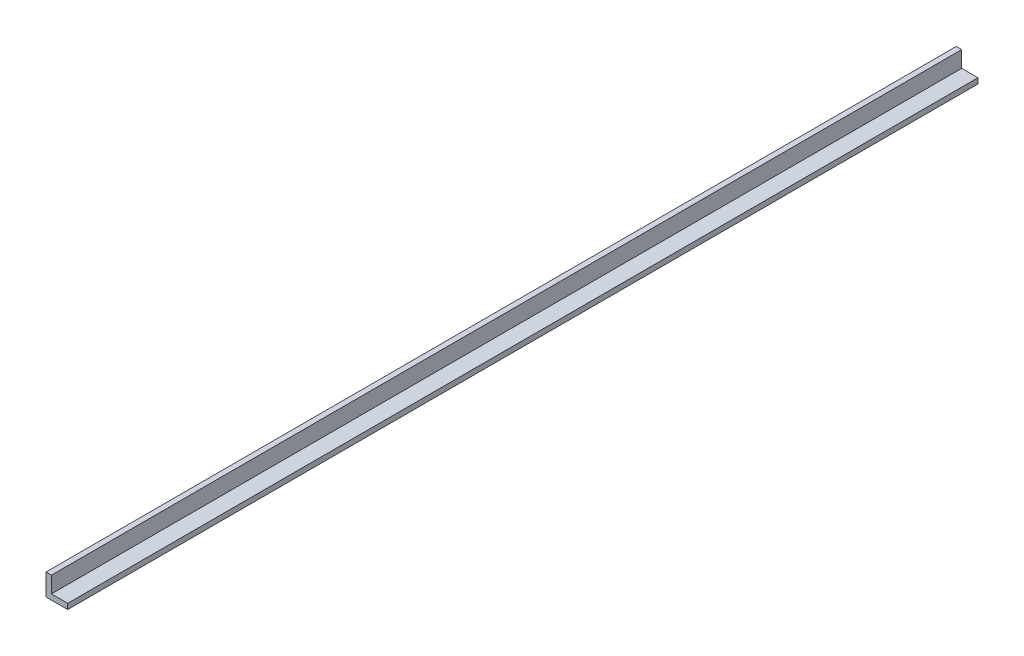
ISO-10303-21;
HEADER;
FILE_DESCRIPTION(('STEP AP214'),'2;1');
FILE_NAME('part.step','',(''),(''),'','','');
FILE_SCHEMA(('AUTOMOTIVE_DESIGN { 1 0 10303 214 1 1 1 1 }'));
ENDSEC;
DATA;
#1=APPLICATION_CONTEXT('core data for automotive mechanical design processes');
#2=APPLICATION_PROTOCOL_DEFINITION('international standard','automotive_design',2000,#1);
#3=PRODUCT_CONTEXT('',#1,'mechanical');
#4=PRODUCT('Part','Part','',(#3));
#5=PRODUCT_RELATED_PRODUCT_CATEGORY('part','',(#4));
#6=PRODUCT_DEFINITION_FORMATION('','',#4);
#7=PRODUCT_DEFINITION_CONTEXT('part definition',#1,'design');
#8=PRODUCT_DEFINITION('design','',#6,#7);
#9=PRODUCT_DEFINITION_SHAPE('','',#8);
#10=(LENGTH_UNIT() NAMED_UNIT(*) SI_UNIT(.MILLI.,.METRE.));
#11=(NAMED_UNIT(*) PLANE_ANGLE_UNIT() SI_UNIT($,.RADIAN.));
#12=(NAMED_UNIT(*) SI_UNIT($,.STERADIAN.) SOLID_ANGLE_UNIT());
#13=UNCERTAINTY_MEASURE_WITH_UNIT(LENGTH_MEASURE(1.E-05),#10,'distance_accuracy_value','');
#14=(GEOMETRIC_REPRESENTATION_CONTEXT(3) GLOBAL_UNCERTAINTY_ASSIGNED_CONTEXT((#13)) GLOBAL_UNIT_ASSIGNED_CONTEXT((#10,
#11,#12)) REPRESENTATION_CONTEXT('',''));
#15=CARTESIAN_POINT('',(0.,0.,0.));
#16=DIRECTION('',(0.,0.,1.));
#17=DIRECTION('',(1.,0.,0.));
#18=AXIS2_PLACEMENT_3D('',#15,#16,#17);
#19=CARTESIAN_POINT('',(25.4,6.35,0.));
#20=DIRECTION('',(0.,1.,0.));
#21=DIRECTION('',(0.,0.,1.));
#22=AXIS2_PLACEMENT_3D('',#19,#20,#21);
#23=PLANE('',#22);
#24=DIRECTION('',(0.,0.,-1.));
#25=VECTOR('',#24,1.);
#26=CARTESIAN_POINT('',(25.4,6.35,0.));
#27=LINE('',#26,#25);
#28=CARTESIAN_POINT('',(25.4,6.35,0.));
#29=VERTEX_POINT('',#28);
#30=CARTESIAN_POINT('',(25.4,6.35,1066.8));
#31=VERTEX_POINT('',#30);
#32=EDGE_CURVE('E72',#29,#31,#27,.F.);
#33=ORIENTED_EDGE('',*,*,#32,.F.);
#34=DIRECTION('',(1.,0.,0.));
#35=VECTOR('',#34,1.);
#36=CARTESIAN_POINT('',(0.,6.35,0.));
#37=LINE('',#36,#35);
#38=CARTESIAN_POINT('',(6.35,6.35,0.));
#39=VERTEX_POINT('',#38);
#40=EDGE_CURVE('E104',#29,#39,#37,.F.);
#41=ORIENTED_EDGE('',*,*,#40,.T.);
#42=DIRECTION('',(0.,0.,-1.));
#43=VECTOR('',#42,1.);
#44=CARTESIAN_POINT('',(6.35,6.35,0.));
#45=LINE('',#44,#43);
#46=CARTESIAN_POINT('',(6.35,6.35,1066.8));
#47=VERTEX_POINT('',#46);
#48=EDGE_CURVE('E20',#47,#39,#45,.T.);
#49=ORIENTED_EDGE('',*,*,#48,.F.);
#50=DIRECTION('',(1.,0.,0.));
#51=VECTOR('',#50,1.);
#52=CARTESIAN_POINT('',(0.,6.35,1066.8));
#53=LINE('',#52,#51);
#54=EDGE_CURVE('E83',#31,#47,#53,.F.);
#55=ORIENTED_EDGE('',*,*,#54,.F.);
#56=EDGE_LOOP('',(#33,#41,#49,#55));
#57=FACE_BOUND('',#56,.T.);
#58=ADVANCED_FACE('F17',(#57),#23,.T.);
#59=CARTESIAN_POINT('',(6.35,6.35,0.));
#60=DIRECTION('',(1.,0.,0.));
#61=DIRECTION('',(0.,0.,-1.));
#62=AXIS2_PLACEMENT_3D('',#59,#60,#61);
#63=PLANE('',#62);
#64=ORIENTED_EDGE('',*,*,#48,.T.);
#65=DIRECTION('',(0.,1.,0.));
#66=VECTOR('',#65,1.);
#67=CARTESIAN_POINT('',(6.35,0.,0.));
#68=LINE('',#67,#66);
#69=CARTESIAN_POINT('',(6.35,25.4,0.));
#70=VERTEX_POINT('',#69);
#71=EDGE_CURVE('E101',#39,#70,#68,.T.);
#72=ORIENTED_EDGE('',*,*,#71,.T.);
#73=DIRECTION('',(0.,0.,1.));
#74=VECTOR('',#73,1.);
#75=CARTESIAN_POINT('',(6.35,25.4,0.));
#76=LINE('',#75,#74);
#77=CARTESIAN_POINT('',(6.35,25.4,1066.8));
#78=VERTEX_POINT('',#77);
#79=EDGE_CURVE('E80',#78,#70,#76,.F.);
#80=ORIENTED_EDGE('',*,*,#79,.F.);
#81=DIRECTION('',(0.,1.,0.));
#82=VECTOR('',#81,1.);
#83=CARTESIAN_POINT('',(6.35,0.,1066.8));
#84=LINE('',#83,#82);
#85=EDGE_CURVE('E86',#47,#78,#84,.T.);
#86=ORIENTED_EDGE('',*,*,#85,.F.);
#87=EDGE_LOOP('',(#64,#72,#80,#86));
#88=FACE_BOUND('',#87,.T.);
#89=ADVANCED_FACE('F100',(#88),#63,.T.);
#90=CARTESIAN_POINT('',(6.35,25.4,0.));
#91=DIRECTION('',(0.,1.,0.));
#92=DIRECTION('',(0.,0.,1.));
#93=AXIS2_PLACEMENT_3D('',#90,#91,#92);
#94=PLANE('',#93);
#95=ORIENTED_EDGE('',*,*,#79,.T.);
#96=DIRECTION('',(1.,0.,0.));
#97=VECTOR('',#96,1.);
#98=CARTESIAN_POINT('',(0.,25.4,0.));
#99=LINE('',#98,#97);
#100=CARTESIAN_POINT('',(0.,25.4,0.));
#101=VERTEX_POINT('',#100);
#102=EDGE_CURVE('E105',#70,#101,#99,.F.);
#103=ORIENTED_EDGE('',*,*,#102,.T.);
#104=DIRECTION('',(0.,0.,1.));
#105=VECTOR('',#104,1.);
#106=CARTESIAN_POINT('',(0.,25.4,0.));
#107=LINE('',#106,#105);
#108=CARTESIAN_POINT('',(0.,25.4,1066.8));
#109=VERTEX_POINT('',#108);
#110=EDGE_CURVE('E112',#109,#101,#107,.F.);
#111=ORIENTED_EDGE('',*,*,#110,.F.);
#112=DIRECTION('',(1.,0.,0.));
#113=VECTOR('',#112,1.);
#114=CARTESIAN_POINT('',(0.,25.4,1066.8));
#115=LINE('',#114,#113);
#116=EDGE_CURVE('E117',#78,#109,#115,.F.);
#117=ORIENTED_EDGE('',*,*,#116,.F.);
#118=EDGE_LOOP('',(#95,#103,#111,#117));
#119=FACE_BOUND('',#118,.T.);
#120=ADVANCED_FACE('F119',(#119),#94,.T.);
#121=CARTESIAN_POINT('',(25.4,0.,0.));
#122=DIRECTION('',(1.,0.,0.));
#123=DIRECTION('',(0.,0.,-1.));
#124=AXIS2_PLACEMENT_3D('',#121,#122,#123);
#125=PLANE('',#124);
#126=DIRECTION('',(0.,0.,-1.));
#127=VECTOR('',#126,1.);
#128=CARTESIAN_POINT('',(25.4,0.,0.));
#129=LINE('',#128,#127);
#130=CARTESIAN_POINT('',(25.4,0.,0.));
#131=VERTEX_POINT('',#130);
#132=CARTESIAN_POINT('',(25.4,0.,1066.8));
#133=VERTEX_POINT('',#132);
#134=EDGE_CURVE('E125',#131,#133,#129,.F.);
#135=ORIENTED_EDGE('',*,*,#134,.F.);
#136=DIRECTION('',(0.,1.,0.));
#137=VECTOR('',#136,1.);
#138=CARTESIAN_POINT('',(25.4,0.,0.));
#139=LINE('',#138,#137);
#140=EDGE_CURVE('E78',#131,#29,#139,.T.);
#141=ORIENTED_EDGE('',*,*,#140,.T.);
#142=ORIENTED_EDGE('',*,*,#32,.T.);
#143=DIRECTION('',(0.,1.,0.));
#144=VECTOR('',#143,1.);
#145=CARTESIAN_POINT('',(25.4,0.,1066.8));
#146=LINE('',#145,#144);
#147=EDGE_CURVE('E75',#133,#31,#146,.T.);
#148=ORIENTED_EDGE('',*,*,#147,.F.);
#149=EDGE_LOOP('',(#135,#141,#142,#148));
#150=FACE_BOUND('',#149,.T.);
#151=ADVANCED_FACE('F73',(#150),#125,.T.);
#152=CARTESIAN_POINT('',(0.,0.,1066.8));
#153=DIRECTION('',(0.,0.,1.));
#154=DIRECTION('',(1.,0.,0.));
#155=AXIS2_PLACEMENT_3D('',#152,#153,#154);
#156=PLANE('',#155);
#157=DIRECTION('',(0.,1.,0.));
#158=VECTOR('',#157,1.);
#159=CARTESIAN_POINT('',(0.,25.4,1066.8));
#160=LINE('',#159,#158);
#161=CARTESIAN_POINT('',(0.,0.,1066.8));
#162=VERTEX_POINT('',#161);
#163=EDGE_CURVE('E114',#162,#109,#160,.T.);
#164=ORIENTED_EDGE('',*,*,#163,.F.);
#165=DIRECTION('',(1.,0.,0.));
#166=VECTOR('',#165,1.);
#167=CARTESIAN_POINT('',(0.,0.,1066.8));
#168=LINE('',#167,#166);
#169=EDGE_CURVE('E90',#133,#162,#168,.F.);
#170=ORIENTED_EDGE('',*,*,#169,.F.);
#171=ORIENTED_EDGE('',*,*,#147,.T.);
#172=ORIENTED_EDGE('',*,*,#54,.T.);
#173=ORIENTED_EDGE('',*,*,#85,.T.);
#174=ORIENTED_EDGE('',*,*,#116,.T.);
#175=EDGE_LOOP('',(#164,#170,#171,#172,#173,#174));
#176=FACE_BOUND('',#175,.T.);
#177=ADVANCED_FACE('F88',(#176),#156,.T.);
#178=CARTESIAN_POINT('',(0.,25.4,0.));
#179=DIRECTION('',(-1.,0.,0.));
#180=DIRECTION('',(0.,0.,1.));
#181=AXIS2_PLACEMENT_3D('',#178,#179,#180);
#182=PLANE('',#181);
#183=ORIENTED_EDGE('',*,*,#110,.T.);
#184=DIRECTION('',(0.,1.,0.));
#185=VECTOR('',#184,1.);
#186=CARTESIAN_POINT('',(0.,0.,0.));
#187=LINE('',#186,#185);
#188=CARTESIAN_POINT('',(0.,0.,0.));
#189=VERTEX_POINT('',#188);
#190=EDGE_CURVE('E35',#101,#189,#187,.F.);
#191=ORIENTED_EDGE('',*,*,#190,.T.);
#192=DIRECTION('',(0.,0.,-1.));
#193=VECTOR('',#192,1.);
#194=CARTESIAN_POINT('',(0.,0.,0.));
#195=LINE('',#194,#193);
#196=EDGE_CURVE('E26',#162,#189,#195,.T.);
#197=ORIENTED_EDGE('',*,*,#196,.F.);
#198=ORIENTED_EDGE('',*,*,#163,.T.);
#199=EDGE_LOOP('',(#183,#191,#197,#198));
#200=FACE_BOUND('',#199,.T.);
#201=ADVANCED_FACE('F120',(#200),#182,.T.);
#202=CARTESIAN_POINT('',(0.,0.,0.));
#203=DIRECTION('',(0.,0.,1.));
#204=DIRECTION('',(1.,0.,0.));
#205=AXIS2_PLACEMENT_3D('',#202,#203,#204);
#206=PLANE('',#205);
#207=ORIENTED_EDGE('',*,*,#102,.F.);
#208=ORIENTED_EDGE('',*,*,#71,.F.);
#209=ORIENTED_EDGE('',*,*,#40,.F.);
#210=ORIENTED_EDGE('',*,*,#140,.F.);
#211=DIRECTION('',(1.,0.,0.));
#212=VECTOR('',#211,1.);
#213=CARTESIAN_POINT('',(0.,0.,0.));
#214=LINE('',#213,#212);
#215=EDGE_CURVE('E11',#189,#131,#214,.T.);
#216=ORIENTED_EDGE('',*,*,#215,.F.);
#217=ORIENTED_EDGE('',*,*,#190,.F.);
#218=EDGE_LOOP('',(#207,#208,#209,#210,#216,#217));
#219=FACE_BOUND('',#218,.T.);
#220=ADVANCED_FACE('F103',(#219),#206,.F.);
#221=CARTESIAN_POINT('',(0.,0.,0.));
#222=DIRECTION('',(0.,-1.,0.));
#223=DIRECTION('',(0.,0.,-1.));
#224=AXIS2_PLACEMENT_3D('',#221,#222,#223);
#225=PLANE('',#224);
#226=ORIENTED_EDGE('',*,*,#196,.T.);
#227=ORIENTED_EDGE('',*,*,#215,.T.);
#228=ORIENTED_EDGE('',*,*,#134,.T.);
#229=ORIENTED_EDGE('',*,*,#169,.T.);
#230=EDGE_LOOP('',(#226,#227,#228,#229));
#231=FACE_BOUND('',#230,.T.);
#232=ADVANCED_FACE('F124',(#231),#225,.T.);
#233=CLOSED_SHELL('',(#58,#89,#120,#151,#177,#201,#220,#232));
#234=MANIFOLD_SOLID_BREP('B1',#233);
#235=ADVANCED_BREP_SHAPE_REPRESENTATION('',(#18,#234),#14);
#236=SHAPE_DEFINITION_REPRESENTATION(#9,#235);
ENDSEC;
END-ISO-10303-21;
